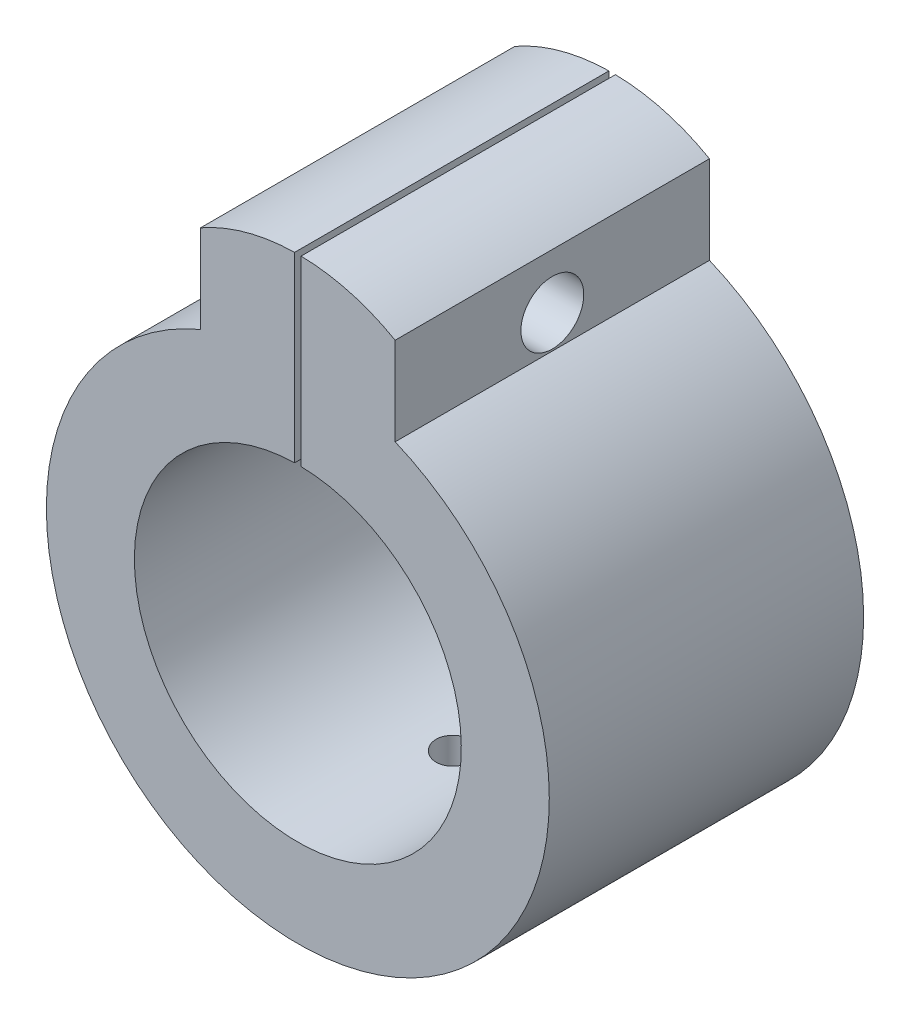
ISO-10303-21;
HEADER;
FILE_DESCRIPTION(('STEP AP214'),'2;1');
FILE_NAME('part.step','',(''),(''),'','','');
FILE_SCHEMA(('AUTOMOTIVE_DESIGN { 1 0 10303 214 1 1 1 1 }'));
ENDSEC;
DATA;
#1=APPLICATION_CONTEXT('core data for automotive mechanical design processes');
#2=APPLICATION_PROTOCOL_DEFINITION('international standard','automotive_design',2000,#1);
#3=PRODUCT_CONTEXT('',#1,'mechanical');
#4=PRODUCT('Part','Part','',(#3));
#5=PRODUCT_RELATED_PRODUCT_CATEGORY('part','',(#4));
#6=PRODUCT_DEFINITION_FORMATION('','',#4);
#7=PRODUCT_DEFINITION_CONTEXT('part definition',#1,'design');
#8=PRODUCT_DEFINITION('design','',#6,#7);
#9=PRODUCT_DEFINITION_SHAPE('','',#8);
#10=(LENGTH_UNIT() NAMED_UNIT(*) SI_UNIT(.MILLI.,.METRE.));
#11=(NAMED_UNIT(*) PLANE_ANGLE_UNIT() SI_UNIT($,.RADIAN.));
#12=(NAMED_UNIT(*) SI_UNIT($,.STERADIAN.) SOLID_ANGLE_UNIT());
#13=UNCERTAINTY_MEASURE_WITH_UNIT(LENGTH_MEASURE(1.E-05),#10,'distance_accuracy_value','');
#14=(GEOMETRIC_REPRESENTATION_CONTEXT(3) GLOBAL_UNCERTAINTY_ASSIGNED_CONTEXT((#13)) GLOBAL_UNIT_ASSIGNED_CONTEXT((#10,
#11,#12)) REPRESENTATION_CONTEXT('',''));
#15=CARTESIAN_POINT('',(0.,0.,0.));
#16=DIRECTION('',(0.,0.,1.));
#17=DIRECTION('',(1.,0.,0.));
#18=AXIS2_PLACEMENT_3D('',#15,#16,#17);
#19=CARTESIAN_POINT('',(0.,11.87489743787,10.));
#20=DIRECTION('',(0.,0.,-1.));
#21=DIRECTION('',(-1.,0.,0.));
#22=AXIS2_PLACEMENT_3D('',#19,#20,#21);
#23=CYLINDRICAL_SURFACE('',#22,15.6193467136848);
#24=DIRECTION('',(0.,0.,-1.));
#25=VECTOR('',#24,1.);
#26=CARTESIAN_POINT('',(-0.258597553957538,27.4921033040735,10.));
#27=LINE('',#26,#25);
#28=CARTESIAN_POINT('',(-0.258597553957538,27.4921033040735,0.));
#29=VERTEX_POINT('',#28);
#30=CARTESIAN_POINT('',(-0.258597553957538,27.4921033040735,25.));
#31=VERTEX_POINT('',#30);
#32=EDGE_CURVE('E163',#29,#31,#27,.F.);
#33=ORIENTED_EDGE('',*,*,#32,.F.);
#34=CARTESIAN_POINT('',(0.,11.87489743787,0.));
#35=DIRECTION('',(0.,0.,1.));
#36=DIRECTION('',(1.,0.,0.));
#37=AXIS2_PLACEMENT_3D('',#34,#35,#36);
#38=CIRCLE('',#37,15.6193467136848);
#39=CARTESIAN_POINT('',(-7.74027571439312,25.441478570472,0.));
#40=VERTEX_POINT('',#39);
#41=EDGE_CURVE('E139',#40,#29,#38,.F.);
#42=ORIENTED_EDGE('',*,*,#41,.F.);
#43=DIRECTION('',(0.,0.,-1.));
#44=VECTOR('',#43,1.);
#45=CARTESIAN_POINT('',(-7.74027571439312,25.441478570472,10.));
#46=LINE('',#45,#44);
#47=CARTESIAN_POINT('',(-7.74027571439312,25.441478570472,25.));
#48=VERTEX_POINT('',#47);
#49=EDGE_CURVE('E79',#48,#40,#46,.T.);
#50=ORIENTED_EDGE('',*,*,#49,.F.);
#51=CARTESIAN_POINT('',(0.,11.8748974378699,25.));
#52=DIRECTION('',(0.,0.,1.));
#53=DIRECTION('',(-1.,0.,0.));
#54=AXIS2_PLACEMENT_3D('',#51,#52,#53);
#55=CIRCLE('',#54,15.6193467136848);
#56=EDGE_CURVE('E156',#31,#48,#55,.T.);
#57=ORIENTED_EDGE('',*,*,#56,.F.);
#58=EDGE_LOOP('',(#33,#42,#50,#57));
#59=FACE_BOUND('',#58,.T.);
#60=ADVANCED_FACE('F36',(#59),#23,.T.);
#61=CARTESIAN_POINT('',(7.74027571439312,0.,10.));
#62=DIRECTION('',(-1.,0.,0.));
#63=DIRECTION('',(0.,0.,1.));
#64=AXIS2_PLACEMENT_3D('',#61,#62,#63);
#65=PLANE('',#64);
#66=CARTESIAN_POINT('',(7.74027571439312,21.0864235760214,12.5));
#67=DIRECTION('',(1.,0.,0.));
#68=DIRECTION('',(0.,0.,-1.));
#69=AXIS2_PLACEMENT_3D('',#66,#67,#68);
#70=CIRCLE('',#69,2.5);
#71=CARTESIAN_POINT('',(7.74027571439312,21.0864235760214,10.));
#72=VERTEX_POINT('',#71);
#73=EDGE_CURVE('E144',#72,#72,#70,.T.);
#74=ORIENTED_EDGE('',*,*,#73,.F.);
#75=EDGE_LOOP('',(#74));
#76=FACE_BOUND('',#75,.T.);
#77=DIRECTION('',(0.,1.,0.));
#78=VECTOR('',#77,1.);
#79=CARTESIAN_POINT('',(7.74027571439312,0.,0.));
#80=LINE('',#79,#78);
#81=CARTESIAN_POINT('',(7.74027571439312,18.441478570472,0.));
#82=VERTEX_POINT('',#81);
#83=CARTESIAN_POINT('',(7.74027571439312,25.441478570472,0.));
#84=VERTEX_POINT('',#83);
#85=EDGE_CURVE('E122',#82,#84,#80,.T.);
#86=ORIENTED_EDGE('',*,*,#85,.T.);
#87=DIRECTION('',(0.,0.,-1.));
#88=VECTOR('',#87,1.);
#89=CARTESIAN_POINT('',(7.74027571439312,25.441478570472,10.));
#90=LINE('',#89,#88);
#91=CARTESIAN_POINT('',(7.74027571439312,25.441478570472,25.));
#92=VERTEX_POINT('',#91);
#93=EDGE_CURVE('E134',#92,#84,#90,.T.);
#94=ORIENTED_EDGE('',*,*,#93,.F.);
#95=DIRECTION('',(0.,1.,0.));
#96=VECTOR('',#95,1.);
#97=CARTESIAN_POINT('',(7.74027571439312,18.441478570472,25.));
#98=LINE('',#97,#96);
#99=CARTESIAN_POINT('',(7.74027571439312,18.441478570472,25.));
#100=VERTEX_POINT('',#99);
#101=EDGE_CURVE('E132',#100,#92,#98,.T.);
#102=ORIENTED_EDGE('',*,*,#101,.F.);
#103=DIRECTION('',(0.,0.,-1.));
#104=VECTOR('',#103,1.);
#105=CARTESIAN_POINT('',(7.74027571439312,18.441478570472,10.));
#106=LINE('',#105,#104);
#107=EDGE_CURVE('E115',#100,#82,#106,.T.);
#108=ORIENTED_EDGE('',*,*,#107,.T.);
#109=EDGE_LOOP('',(#86,#94,#102,#108));
#110=FACE_BOUND('',#109,.T.);
#111=ADVANCED_FACE('F38',(#76,#110),#65,.F.);
#112=DIRECTION('',(0.,0.,-1.));
#113=VECTOR('',#112,1.);
#114=CARTESIAN_POINT('',(0.258597553957538,27.4921033040735,10.));
#115=LINE('',#114,#113);
#116=CARTESIAN_POINT('',(0.258597553957538,27.4921033040735,25.));
#117=VERTEX_POINT('',#116);
#118=CARTESIAN_POINT('',(0.258597553957538,27.4921033040735,0.));
#119=VERTEX_POINT('',#118);
#120=EDGE_CURVE('E170',#117,#119,#115,.T.);
#121=ORIENTED_EDGE('',*,*,#120,.F.);
#122=EDGE_CURVE('E153',#92,#117,#55,.T.);
#123=ORIENTED_EDGE('',*,*,#122,.F.);
#124=ORIENTED_EDGE('',*,*,#93,.T.);
#125=EDGE_CURVE('E126',#119,#84,#38,.F.);
#126=ORIENTED_EDGE('',*,*,#125,.F.);
#127=EDGE_LOOP('',(#121,#123,#124,#126));
#128=FACE_BOUND('',#127,.T.);
#129=ADVANCED_FACE('F226',(#128),#23,.T.);
#130=CARTESIAN_POINT('',(-7.74027571439312,0.,10.));
#131=DIRECTION('',(-1.,0.,0.));
#132=DIRECTION('',(0.,0.,1.));
#133=AXIS2_PLACEMENT_3D('',#130,#131,#132);
#134=PLANE('',#133);
#135=CARTESIAN_POINT('',(-7.74027571439312,21.0864235760214,12.5));
#136=DIRECTION('',(-1.,0.,0.));
#137=DIRECTION('',(0.,0.,1.));
#138=AXIS2_PLACEMENT_3D('',#135,#136,#137);
#139=CIRCLE('',#138,2.5);
#140=CARTESIAN_POINT('',(-7.74027571439312,21.0864235760214,15.));
#141=VERTEX_POINT('',#140);
#142=EDGE_CURVE('E175',#141,#141,#139,.T.);
#143=ORIENTED_EDGE('',*,*,#142,.F.);
#144=EDGE_LOOP('',(#143));
#145=FACE_BOUND('',#144,.T.);
#146=DIRECTION('',(0.,1.,0.));
#147=VECTOR('',#146,1.);
#148=CARTESIAN_POINT('',(-7.74027571439312,0.,0.));
#149=LINE('',#148,#147);
#150=CARTESIAN_POINT('',(-7.74027571439312,18.441478570472,0.));
#151=VERTEX_POINT('',#150);
#152=EDGE_CURVE('E119',#151,#40,#149,.T.);
#153=ORIENTED_EDGE('',*,*,#152,.F.);
#154=DIRECTION('',(0.,0.,-1.));
#155=VECTOR('',#154,1.);
#156=CARTESIAN_POINT('',(-7.74027571439312,18.441478570472,10.));
#157=LINE('',#156,#155);
#158=CARTESIAN_POINT('',(-7.74027571439312,18.441478570472,25.));
#159=VERTEX_POINT('',#158);
#160=EDGE_CURVE('E117',#159,#151,#157,.T.);
#161=ORIENTED_EDGE('',*,*,#160,.F.);
#162=DIRECTION('',(0.,-1.,0.));
#163=VECTOR('',#162,1.);
#164=CARTESIAN_POINT('',(-7.74027571439312,18.441478570472,25.));
#165=LINE('',#164,#163);
#166=EDGE_CURVE('E129',#48,#159,#165,.T.);
#167=ORIENTED_EDGE('',*,*,#166,.F.);
#168=ORIENTED_EDGE('',*,*,#49,.T.);
#169=EDGE_LOOP('',(#153,#161,#167,#168));
#170=FACE_BOUND('',#169,.T.);
#171=ADVANCED_FACE('F220',(#145,#170),#134,.T.);
#172=CARTESIAN_POINT('',(0.,0.,10.));
#173=DIRECTION('',(0.,0.,-1.));
#174=DIRECTION('',(-1.,0.,0.));
#175=AXIS2_PLACEMENT_3D('',#172,#173,#174);
#176=CYLINDRICAL_SURFACE('',#175,20.);
#177=CARTESIAN_POINT('',(0.,-20.,14.));
#178=CARTESIAN_POINT('',(0.0841288095114433,-19.9999992582729,13.999996313183));
#179=CARTESIAN_POINT('',(0.168315601024087,-19.9994635090758,13.9928985465594));
#180=CARTESIAN_POINT('',(0.334361941971538,-19.9973778078798,13.9646875154567));
#181=CARTESIAN_POINT('',(0.416218711162994,-19.9958266932389,13.943558183763));
#182=CARTESIAN_POINT('',(0.575175965959818,-19.9918856268593,13.8878966718803));
#183=CARTESIAN_POINT('',(0.652279036935091,-19.9894961359011,13.8533718528915));
#184=CARTESIAN_POINT('',(0.799576480678019,-19.9841466247064,13.7719120471363));
#185=CARTESIAN_POINT('',(0.869772371799849,-19.9811867302827,13.724979796204));
#186=CARTESIAN_POINT('',(1.00142895753254,-19.975021868989,13.6199307794625));
#187=CARTESIAN_POINT('',(1.06287322971852,-19.971816458291,13.5617934559158));
#188=CARTESIAN_POINT('',(1.17514165369782,-19.9655255838438,13.4360277026551));
#189=CARTESIAN_POINT('',(1.22596534904266,-19.9624401252546,13.3683988652259));
#190=CARTESIAN_POINT('',(1.31560383874766,-19.9567335395977,13.2254725451906));
#191=CARTESIAN_POINT('',(1.35440446810332,-19.954112961772,13.1501661549699));
#192=CARTESIAN_POINT('',(1.41880489046782,-19.9496376121017,12.9940846276562));
#193=CARTESIAN_POINT('',(1.44440487688688,-19.947782829037,12.9133095707074));
#194=CARTESIAN_POINT('',(1.48163037657928,-19.9450525889002,12.7487461075994));
#195=CARTESIAN_POINT('',(1.49328231044217,-19.9441752805014,12.6649637091924));
#196=CARTESIAN_POINT('',(1.50236254574838,-19.9434933892539,12.4966280467393));
#197=CARTESIAN_POINT('',(1.49979106810858,-19.943688789744,12.4120747946865));
#198=CARTESIAN_POINT('',(1.48051934417569,-19.9451285636931,12.2447781889461));
#199=CARTESIAN_POINT('',(1.46384775676394,-19.9463708093904,12.1620315130358));
#200=CARTESIAN_POINT('',(1.4168935522692,-19.9497609519804,12.0005143028844));
#201=CARTESIAN_POINT('',(1.38661082447336,-19.9519088562398,11.9217438009912));
#202=CARTESIAN_POINT('',(1.31326167189701,-19.9568707353614,11.7703232837612));
#203=CARTESIAN_POINT('',(1.27018232726496,-19.9596853828032,11.6976795498232));
#204=CARTESIAN_POINT('',(1.17247213743423,-19.9656629459514,11.5606433371351));
#205=CARTESIAN_POINT('',(1.11784110342877,-19.9688258673499,11.4962509932776));
#206=CARTESIAN_POINT('',(0.998417278432273,-19.9751530336147,11.3773787417564));
#207=CARTESIAN_POINT('',(0.933599700176313,-19.978317262423,11.3229237324053));
#208=CARTESIAN_POINT('',(0.795729375934442,-19.9842830152099,11.2256642364343));
#209=CARTESIAN_POINT('',(0.722676625718591,-19.9870845390023,11.1828597557987));
#210=CARTESIAN_POINT('',(0.570393940216334,-19.9920096041928,11.1101181697562));
#211=CARTESIAN_POINT('',(0.491163509428978,-19.9941330911371,11.0801820977587));
#212=CARTESIAN_POINT('',(0.328781652774543,-19.9974621500133,11.0340441877952));
#213=CARTESIAN_POINT('',(0.245630292842573,-19.998667737375,11.0178421189623));
#214=CARTESIAN_POINT('',(0.0779828437837506,-20.0000231735387,10.9996631904611));
#215=CARTESIAN_POINT('',(-0.00650949482532079,-20.0001755757578,10.9976519253458));
#216=CARTESIAN_POINT('',(-0.174630230993063,-19.9994142771364,11.0078216680697));
#217=CARTESIAN_POINT('',(-0.258258635054597,-19.9985005843263,11.0200025690053));
#218=CARTESIAN_POINT('',(-0.422180011176504,-19.9957115375324,11.0581823688106));
#219=CARTESIAN_POINT('',(-0.50247670164607,-19.9938372886011,11.0841653905587));
#220=CARTESIAN_POINT('',(-0.657570327384028,-19.9893378090841,11.1491956936367));
#221=CARTESIAN_POINT('',(-0.732367191799398,-19.9867125688255,11.1882431432368));
#222=CARTESIAN_POINT('',(-0.87449495937676,-19.9809993255836,11.2783808378979));
#223=CARTESIAN_POINT('',(-0.941811320255548,-19.9779104477497,11.3294939567188));
#224=CARTESIAN_POINT('',(-1.06692059601702,-19.9716201639251,11.4422789254691));
#225=CARTESIAN_POINT('',(-1.1247133767348,-19.9684187563499,11.5039509241233));
#226=CARTESIAN_POINT('',(-1.22925234979154,-19.9622567375937,11.6362519401321));
#227=CARTESIAN_POINT('',(-1.27597614708765,-19.9592966224009,11.706898679433));
#228=CARTESIAN_POINT('',(-1.35689744472608,-19.9539590285433,11.8550551983815));
#229=CARTESIAN_POINT('',(-1.39109504958689,-19.951581545017,11.9325649207578));
#230=CARTESIAN_POINT('',(-1.44595479238458,-19.9476809567371,12.0921668074873));
#231=CARTESIAN_POINT('',(-1.46663080672911,-19.9461569763152,12.1742541798527));
#232=CARTESIAN_POINT('',(-1.49390569339177,-19.9441328652441,12.3407472310157));
#233=CARTESIAN_POINT('',(-1.50050477907388,-19.9436327190765,12.4251528746556));
#234=CARTESIAN_POINT('',(-1.49943621553155,-19.9437130691626,12.5936639132474));
#235=CARTESIAN_POINT('',(-1.49180376085723,-19.9442908995857,12.6777695348961));
#236=CARTESIAN_POINT('',(-1.46256198193398,-19.9464564369575,12.84350108371));
#237=CARTESIAN_POINT('',(-1.44095263443385,-19.9480441455862,12.9251270067498));
#238=CARTESIAN_POINT('',(-1.38437900273526,-19.952049853556,13.0835856084218));
#239=CARTESIAN_POINT('',(-1.34941515840954,-19.9544678255495,13.1604184448325));
#240=CARTESIAN_POINT('',(-1.26712924619683,-19.9598616237908,13.3071289577146));
#241=CARTESIAN_POINT('',(-1.21980742681008,-19.9628374388209,13.3770067740018));
#242=CARTESIAN_POINT('',(-1.11401708946728,-19.9690203079162,13.508003349971));
#243=CARTESIAN_POINT('',(-1.05552268820001,-19.972227887963,13.5691011816401));
#244=CARTESIAN_POINT('',(-0.929090973452718,-19.9785081329158,13.6806340503108));
#245=CARTESIAN_POINT('',(-0.861151367795686,-19.9815807648333,13.7310664915061));
#246=CARTESIAN_POINT('',(-0.717650416603838,-19.9872494022766,13.8198911625391));
#247=CARTESIAN_POINT('',(-0.642077148267445,-19.9898446437752,13.858264160491));
#248=CARTESIAN_POINT('',(-0.48559391791521,-19.9942566719576,13.9217282844403));
#249=CARTESIAN_POINT('',(-0.404690263737666,-19.9960743603405,13.9468348030683));
#250=CARTESIAN_POINT('',(-0.26941791672437,-19.9982556200579,13.9766019885269));
#251=CARTESIAN_POINT('',(-0.215921192938044,-19.9989068154638,13.9853647187894));
#252=CARTESIAN_POINT('',(-0.10829098794799,-19.9997792437292,13.9970649051523));
#253=CARTESIAN_POINT('',(-0.0541575080690685,-20.0000004774832,14.0000023733704));
#254=CARTESIAN_POINT('',(0.,-20.,14.));
#255=B_SPLINE_CURVE_WITH_KNOTS('',3,(#177,#178,#179,#180,#181,#182,#183,#184,#185,#186,#187,
#188,#189,#190,#191,#192,#193,#194,#195,#196,#197,#198,#199,#200,#201,#202,#203,#204,#205,#206,
#207,#208,#209,#210,#211,#212,#213,#214,#215,#216,#217,#218,#219,#220,#221,#222,#223,#224,#225,
#226,#227,#228,#229,#230,#231,#232,#233,#234,#235,#236,#237,#238,#239,#240,#241,#242,#243,#244,
#245,#246,#247,#248,#249,#250,#251,#252,#253,#254),.UNSPECIFIED.,.T.,.F.,(4,2,2,2,2,2,2,2,2,2,2,
2,2,2,2,2,2,2,2,2,2,2,2,2,2,2,2,2,2,2,2,2,2,2,2,2,2,2,4),(0.,0.252188706341403,
0.504666687116075,0.757006120137033,1.00928995874569,1.2620411413344,1.51480318436672,
1.76786189721254,2.02091690224424,2.27349180470371,2.52606278420137,2.7781216361643,
3.0301825384079,3.28249879898397,3.53481918386621,3.78776333637314,4.04070761880367,
4.29367221036427,4.54663254953898,4.79897937776532,5.05132430518305,5.30337957695229,
5.55543809532427,5.8079783521194,6.06052216631005,6.31357265115638,6.56662102450254,
6.8194093000692,7.07219374409736,7.32435388202406,7.57651443943157,7.82866669184701,
8.08081387425119,8.33355244628146,8.58635246072108,8.83955360771711,9.09246032562223,
9.25480590484755,9.41715114636383),.UNSPECIFIED.);
#256=CARTESIAN_POINT('',(0.,-20.,14.));
#257=VERTEX_POINT('',#256);
#258=EDGE_CURVE('E182',#257,#257,#255,.T.);
#259=ORIENTED_EDGE('',*,*,#258,.T.);
#260=EDGE_LOOP('',(#259));
#261=FACE_BOUND('',#260,.T.);
#262=CARTESIAN_POINT('',(0.,0.,0.));
#263=DIRECTION('',(0.,0.,1.));
#264=DIRECTION('',(1.,0.,0.));
#265=AXIS2_PLACEMENT_3D('',#262,#263,#264);
#266=CIRCLE('',#265,20.);
#267=EDGE_CURVE('E71',#151,#82,#266,.T.);
#268=ORIENTED_EDGE('',*,*,#267,.T.);
#269=ORIENTED_EDGE('',*,*,#107,.F.);
#270=CARTESIAN_POINT('',(0.,0.,25.));
#271=DIRECTION('',(0.,0.,1.));
#272=DIRECTION('',(1.,0.,0.));
#273=AXIS2_PLACEMENT_3D('',#270,#271,#272);
#274=CIRCLE('',#273,20.);
#275=EDGE_CURVE('E158',#159,#100,#274,.T.);
#276=ORIENTED_EDGE('',*,*,#275,.F.);
#277=ORIENTED_EDGE('',*,*,#160,.T.);
#278=EDGE_LOOP('',(#268,#269,#276,#277));
#279=FACE_BOUND('',#278,.T.);
#280=ADVANCED_FACE('F112',(#261,#279),#176,.T.);
#281=CARTESIAN_POINT('',(0.,0.,10.));
#282=DIRECTION('',(0.,0.,-1.));
#283=DIRECTION('',(-1.,0.,0.));
#284=AXIS2_PLACEMENT_3D('',#281,#282,#283);
#285=CYLINDRICAL_SURFACE('',#284,13.);
#286=CARTESIAN_POINT('',(0.,-13.,14.));
#287=CARTESIAN_POINT('',(0.0839563147427423,-12.9999989044515,13.9999964031671));
#288=CARTESIAN_POINT('',(0.167966345196187,-12.999178081572,13.9929275849652));
#289=CARTESIAN_POINT('',(0.333652235419372,-12.995982599614,13.9648382649666));
#290=CARTESIAN_POINT('',(0.415325505475653,-12.9936062813601,13.9438028653164));
#291=CARTESIAN_POINT('',(0.57391497224922,-12.9875677351869,13.8884053338572));
#292=CARTESIAN_POINT('',(0.650834199520698,-12.9839063366207,13.8540517956907));
#293=CARTESIAN_POINT('',(0.79779979378714,-12.9757057473599,13.7730111181213));
#294=CARTESIAN_POINT('',(0.867847413269117,-12.9711667170809,13.7263262321012));
#295=CARTESIAN_POINT('',(0.999427807179225,-12.9616943551208,13.6217119644012));
#296=CARTESIAN_POINT('',(1.06092347729183,-12.9567594432832,13.5637360526228));
#297=CARTESIAN_POINT('',(1.17333502414497,-12.9470643855765,13.4382851632476));
#298=CARTESIAN_POINT('',(1.2242503828419,-12.9423042482743,13.3708097207967));
#299=CARTESIAN_POINT('',(1.3141916873334,-12.9334819604022,13.2280373361048));
#300=CARTESIAN_POINT('',(1.3531833171573,-12.9294218388056,13.1527186399223));
#301=CARTESIAN_POINT('',(1.41795120910938,-12.9224797052987,12.9965478380412));
#302=CARTESIAN_POINT('',(1.44372790011126,-12.9195976551562,12.915695912013));
#303=CARTESIAN_POINT('',(1.48122247723766,-12.9153528047108,12.7511364753763));
#304=CARTESIAN_POINT('',(1.49300261981048,-12.9139832786549,12.6674433262594));
#305=CARTESIAN_POINT('',(1.50236226854616,-12.9128978570991,12.4992575604559));
#306=CARTESIAN_POINT('',(1.49994226427626,-12.9131819045903,12.4147649714312));
#307=CARTESIAN_POINT('',(1.48102150197295,-12.9153653842397,12.2478106867289));
#308=CARTESIAN_POINT('',(1.46458907258954,-12.9172569773873,12.1653411304074));
#309=CARTESIAN_POINT('',(1.41821640637187,-12.9224301836669,12.0043381059818));
#310=CARTESIAN_POINT('',(1.38827593305336,-12.9257118211342,11.9258047068143));
#311=CARTESIAN_POINT('',(1.31566282618376,-12.9333043079058,11.7746895307639));
#312=CARTESIAN_POINT('',(1.27296024500285,-12.9376175732259,11.7021222704977));
#313=CARTESIAN_POINT('',(1.17605655290097,-12.9467853893456,11.5651582704928));
#314=CARTESIAN_POINT('',(1.12185499363063,-12.9516399612475,11.5007618494945));
#315=CARTESIAN_POINT('',(1.0031120359915,-12.9613782949516,11.3815707161917));
#316=CARTESIAN_POINT('',(0.93851169434214,-12.9662620604919,11.3268347087021));
#317=CARTESIAN_POINT('',(0.801008592236031,-12.9754816969276,11.2289743878324));
#318=CARTESIAN_POINT('',(0.7281058171361,-12.9798175668567,11.1858500949327));
#319=CARTESIAN_POINT('',(0.576023905679871,-12.9874550212078,11.1124382871552));
#320=CARTESIAN_POINT('',(0.496843118716626,-12.9907563324875,11.0821541615714));
#321=CARTESIAN_POINT('',(0.334473831095743,-12.9959501177405,11.0353274726576));
#322=CARTESIAN_POINT('',(0.251285490311375,-12.9978426478647,11.018784361637));
#323=CARTESIAN_POINT('',(0.0837704200050176,-12.999998373659,10.9999847236204));
#324=CARTESIAN_POINT('',(-0.000547113543200348,-13.0002707984128,10.9976472710681));
#325=CARTESIAN_POINT('',(-0.168372695685006,-12.9991804669134,11.007112154611));
#326=CARTESIAN_POINT('',(-0.251880758889223,-12.9978177402298,11.0189142350122));
#327=CARTESIAN_POINT('',(-0.415480266956156,-12.993616027243,11.056255972808));
#328=CARTESIAN_POINT('',(-0.49558056887289,-12.9907811576039,11.0817573287088));
#329=CARTESIAN_POINT('',(-0.650367161714354,-12.9839527929212,11.145734096229));
#330=CARTESIAN_POINT('',(-0.725053293857112,-12.9799592639147,11.1842098881644));
#331=CARTESIAN_POINT('',(-0.867254744569761,-12.9712363785455,11.2732411451229));
#332=CARTESIAN_POINT('',(-0.934736878832463,-12.9665038451426,11.3238492959128));
#333=CARTESIAN_POINT('',(-1.06027784673837,-12.9568430886348,11.4356337448152));
#334=CARTESIAN_POINT('',(-1.11833636324618,-12.9519148589511,11.4968103984491));
#335=CARTESIAN_POINT('',(-1.22366664140002,-12.9423899602444,11.6283503853359));
#336=CARTESIAN_POINT('',(-1.27088497439797,-12.9377950067668,11.6987566435089));
#337=CARTESIAN_POINT('',(-1.35282617315314,-12.9294843210235,11.846547575845));
#338=CARTESIAN_POINT('',(-1.38754925754463,-12.9257685733744,11.9239321278765));
#339=CARTESIAN_POINT('',(-1.44342658284102,-12.9196483466479,12.0833061537355));
#340=CARTESIAN_POINT('',(-1.46461162925533,-12.91724089246,12.1652847079304));
#341=CARTESIAN_POINT('',(-1.49291104062265,-12.9140010380224,12.3316649395144));
#342=CARTESIAN_POINT('',(-1.50002595610949,-12.9131685761468,12.4160665219645));
#343=CARTESIAN_POINT('',(-1.49997405326828,-12.9131745631781,12.5843656537594));
#344=CARTESIAN_POINT('',(-1.49289116482699,-12.9140031925958,12.668263241811));
#345=CARTESIAN_POINT('',(-1.46482172327171,-12.9172169582806,12.8336675019932));
#346=CARTESIAN_POINT('',(-1.44383516225563,-12.9196020954323,12.915174172765));
#347=CARTESIAN_POINT('',(-1.38857911797313,-12.9256572251488,13.0734760916893));
#348=CARTESIAN_POINT('',(-1.35431304208042,-12.9293268880955,13.1502725425812));
#349=CARTESIAN_POINT('',(-1.27347900341466,-12.9375381901497,13.2970384003879));
#350=CARTESIAN_POINT('',(-1.22691097725304,-12.9420798337501,13.3670077721221));
#351=CARTESIAN_POINT('',(-1.12248173071088,-12.9515555600008,13.4985629533293));
#352=CARTESIAN_POINT('',(-1.06455790771248,-12.9564917239034,13.560098921175));
#353=CARTESIAN_POINT('',(-0.939190054186289,-12.9661816355574,13.6726111148908));
#354=CARTESIAN_POINT('',(-0.871743768617548,-12.9709353397599,13.7235848324088));
#355=CARTESIAN_POINT('',(-0.728996893197092,-12.9797415177439,13.8136635640703));
#356=CARTESIAN_POINT('',(-0.653671391511422,-12.9837916526637,13.8527293056854));
#357=CARTESIAN_POINT('',(-0.497527270565883,-12.9907101076694,13.9176031050395));
#358=CARTESIAN_POINT('',(-0.416714824913399,-12.993579731148,13.9434257921356));
#359=CARTESIAN_POINT('',(-0.279556305332049,-12.9971099824635,13.9747928548381));
#360=CARTESIAN_POINT('',(-0.224080319679961,-12.9981885527758,13.9842322271337));
#361=CARTESIAN_POINT('',(-0.112410914672187,-12.9996339262189,13.9968369852807));
#362=CARTESIAN_POINT('',(-0.0562174995863219,-13.0000007335839,14.0000024084544));
#363=CARTESIAN_POINT('',(0.,-13.,14.));
#364=B_SPLINE_CURVE_WITH_KNOTS('',3,(#286,#287,#288,#289,#290,#291,#292,#293,#294,#295,#296,
#297,#298,#299,#300,#301,#302,#303,#304,#305,#306,#307,#308,#309,#310,#311,#312,#313,#314,#315,
#316,#317,#318,#319,#320,#321,#322,#323,#324,#325,#326,#327,#328,#329,#330,#331,#332,#333,#334,
#335,#336,#337,#338,#339,#340,#341,#342,#343,#344,#345,#346,#347,#348,#349,#350,#351,#352,#353,
#354,#355,#356,#357,#358,#359,#360,#361,#362,#363),.UNSPECIFIED.,.T.,.F.,(4,2,2,2,2,2,2,2,2,2,2,
2,2,2,2,2,2,2,2,2,2,2,2,2,2,2,2,2,2,2,2,2,2,2,2,2,2,2,4),(0.,0.251663624421979,
0.503596125244171,0.755366334321088,1.00709056767771,1.25987498270023,1.51267177188699,
1.76618939688668,2.0196987937799,2.27207631201581,2.52444512928255,2.77559031440111,
3.02673989646913,3.27848351780672,3.53023695652505,3.7834711988091,4.0367058877347,
4.29000737900444,4.54329877367693,4.79514587715501,5.04698842639316,5.29813049175019,
5.54927991940194,5.80154039645153,6.05380936112788,6.30729621090899,6.56077862511548,
6.81368217226278,7.0665758236448,7.31797891068329,7.56938214060554,7.82072090595902,
8.07206096641734,8.32482769676521,8.57765438622356,8.83130609524226,9.08467699305617,
9.25319301127889,9.42170802703663),.UNSPECIFIED.);
#365=CARTESIAN_POINT('',(0.,-13.,14.));
#366=VERTEX_POINT('',#365);
#367=EDGE_CURVE('E40',#366,#366,#364,.T.);
#368=ORIENTED_EDGE('',*,*,#367,.F.);
#369=EDGE_LOOP('',(#368));
#370=FACE_BOUND('',#369,.T.);
#371=DIRECTION('',(0.,0.,-1.));
#372=VECTOR('',#371,1.);
#373=CARTESIAN_POINT('',(-0.258597553957538,12.9974277187868,10.));
#374=LINE('',#373,#372);
#375=CARTESIAN_POINT('',(-0.258597553957538,12.9974277187868,25.));
#376=VERTEX_POINT('',#375);
#377=CARTESIAN_POINT('',(-0.258597553957538,12.9974277187868,0.));
#378=VERTEX_POINT('',#377);
#379=EDGE_CURVE('E165',#376,#378,#374,.T.);
#380=ORIENTED_EDGE('',*,*,#379,.F.);
#381=CARTESIAN_POINT('',(0.,0.,25.));
#382=DIRECTION('',(0.,0.,1.));
#383=DIRECTION('',(1.,0.,0.));
#384=AXIS2_PLACEMENT_3D('',#381,#382,#383);
#385=CIRCLE('',#384,13.);
#386=CARTESIAN_POINT('',(0.258597553957538,12.9974277187868,25.));
#387=VERTEX_POINT('',#386);
#388=EDGE_CURVE('E160',#376,#387,#385,.T.);
#389=ORIENTED_EDGE('',*,*,#388,.T.);
#390=DIRECTION('',(0.,0.,-1.));
#391=VECTOR('',#390,1.);
#392=CARTESIAN_POINT('',(0.258597553957538,12.9974277187868,10.));
#393=LINE('',#392,#391);
#394=CARTESIAN_POINT('',(0.258597553957538,12.9974277187868,0.));
#395=VERTEX_POINT('',#394);
#396=EDGE_CURVE('E59',#395,#387,#393,.F.);
#397=ORIENTED_EDGE('',*,*,#396,.F.);
#398=CARTESIAN_POINT('',(0.,0.,0.));
#399=DIRECTION('',(0.,0.,1.));
#400=DIRECTION('',(1.,0.,0.));
#401=AXIS2_PLACEMENT_3D('',#398,#399,#400);
#402=CIRCLE('',#401,13.);
#403=EDGE_CURVE('E118',#378,#395,#402,.T.);
#404=ORIENTED_EDGE('',*,*,#403,.F.);
#405=EDGE_LOOP('',(#380,#389,#397,#404));
#406=FACE_BOUND('',#405,.T.);
#407=ADVANCED_FACE('F213',(#370,#406),#285,.F.);
#408=CARTESIAN_POINT('',(0.,0.,0.));
#409=DIRECTION('',(0.,0.,1.));
#410=DIRECTION('',(1.,0.,0.));
#411=AXIS2_PLACEMENT_3D('',#408,#409,#410);
#412=PLANE('',#411);
#413=ORIENTED_EDGE('',*,*,#85,.F.);
#414=ORIENTED_EDGE('',*,*,#267,.F.);
#415=ORIENTED_EDGE('',*,*,#152,.T.);
#416=ORIENTED_EDGE('',*,*,#41,.T.);
#417=DIRECTION('',(0.,-1.,0.));
#418=VECTOR('',#417,1.);
#419=CARTESIAN_POINT('',(-0.258597553957538,0.,0.));
#420=LINE('',#419,#418);
#421=EDGE_CURVE('E167',#29,#378,#420,.T.);
#422=ORIENTED_EDGE('',*,*,#421,.T.);
#423=ORIENTED_EDGE('',*,*,#403,.T.);
#424=DIRECTION('',(0.,1.,0.));
#425=VECTOR('',#424,1.);
#426=CARTESIAN_POINT('',(0.258597553957538,0.,0.));
#427=LINE('',#426,#425);
#428=EDGE_CURVE('E173',#395,#119,#427,.T.);
#429=ORIENTED_EDGE('',*,*,#428,.T.);
#430=ORIENTED_EDGE('',*,*,#125,.T.);
#431=EDGE_LOOP('',(#413,#414,#415,#416,#422,#423,#429,#430));
#432=FACE_BOUND('',#431,.T.);
#433=ADVANCED_FACE('F123',(#432),#412,.F.);
#434=CARTESIAN_POINT('',(0.,0.,25.));
#435=DIRECTION('',(0.,0.,1.));
#436=DIRECTION('',(1.,0.,0.));
#437=AXIS2_PLACEMENT_3D('',#434,#435,#436);
#438=PLANE('',#437);
#439=DIRECTION('',(0.,-1.,0.));
#440=VECTOR('',#439,1.);
#441=CARTESIAN_POINT('',(-0.258597553957538,0.,25.));
#442=LINE('',#441,#440);
#443=EDGE_CURVE('E11',#31,#376,#442,.T.);
#444=ORIENTED_EDGE('',*,*,#443,.F.);
#445=ORIENTED_EDGE('',*,*,#56,.T.);
#446=ORIENTED_EDGE('',*,*,#166,.T.);
#447=ORIENTED_EDGE('',*,*,#275,.T.);
#448=ORIENTED_EDGE('',*,*,#101,.T.);
#449=ORIENTED_EDGE('',*,*,#122,.T.);
#450=DIRECTION('',(0.,1.,0.));
#451=VECTOR('',#450,1.);
#452=CARTESIAN_POINT('',(0.258597553957538,0.,25.));
#453=LINE('',#452,#451);
#454=EDGE_CURVE('E50',#387,#117,#453,.T.);
#455=ORIENTED_EDGE('',*,*,#454,.F.);
#456=ORIENTED_EDGE('',*,*,#388,.F.);
#457=EDGE_LOOP('',(#444,#445,#446,#447,#448,#449,#455,#456));
#458=FACE_BOUND('',#457,.T.);
#459=ADVANCED_FACE('F207',(#458),#438,.T.);
#460=CARTESIAN_POINT('',(0.258597553957538,12.3781063786396,-2.50000000007189E-05));
#461=DIRECTION('',(1.,0.,0.));
#462=DIRECTION('',(0.,0.,-1.));
#463=AXIS2_PLACEMENT_3D('',#460,#461,#462);
#464=PLANE('',#463);
#465=CARTESIAN_POINT('',(0.258597553957539,21.0864235760214,12.5));
#466=DIRECTION('',(1.,0.,0.));
#467=DIRECTION('',(0.,0.,-1.));
#468=AXIS2_PLACEMENT_3D('',#465,#466,#467);
#469=CIRCLE('',#468,2.5);
#470=CARTESIAN_POINT('',(0.258597553957539,21.0864235760214,10.));
#471=VERTEX_POINT('',#470);
#472=EDGE_CURVE('E143',#471,#471,#469,.T.);
#473=ORIENTED_EDGE('',*,*,#472,.T.);
#474=EDGE_LOOP('',(#473));
#475=FACE_BOUND('',#474,.T.);
#476=ORIENTED_EDGE('',*,*,#120,.T.);
#477=ORIENTED_EDGE('',*,*,#428,.F.);
#478=ORIENTED_EDGE('',*,*,#396,.T.);
#479=ORIENTED_EDGE('',*,*,#454,.T.);
#480=EDGE_LOOP('',(#476,#477,#478,#479));
#481=FACE_BOUND('',#480,.T.);
#482=ADVANCED_FACE('F203',(#475,#481),#464,.F.);
#483=CARTESIAN_POINT('',(-0.258597553957538,12.3781063786396,-2.50000000007189E-05));
#484=DIRECTION('',(-1.,0.,0.));
#485=DIRECTION('',(0.,0.,1.));
#486=AXIS2_PLACEMENT_3D('',#483,#484,#485);
#487=PLANE('',#486);
#488=CARTESIAN_POINT('',(-0.258597553957539,21.0864235760214,12.5));
#489=DIRECTION('',(-1.,0.,0.));
#490=DIRECTION('',(0.,0.,1.));
#491=AXIS2_PLACEMENT_3D('',#488,#489,#490);
#492=CIRCLE('',#491,2.5);
#493=CARTESIAN_POINT('',(-0.258597553957539,21.0864235760214,15.));
#494=VERTEX_POINT('',#493);
#495=EDGE_CURVE('E141',#494,#494,#492,.T.);
#496=ORIENTED_EDGE('',*,*,#495,.T.);
#497=EDGE_LOOP('',(#496));
#498=FACE_BOUND('',#497,.T.);
#499=ORIENTED_EDGE('',*,*,#32,.T.);
#500=ORIENTED_EDGE('',*,*,#443,.T.);
#501=ORIENTED_EDGE('',*,*,#379,.T.);
#502=ORIENTED_EDGE('',*,*,#421,.F.);
#503=EDGE_LOOP('',(#499,#500,#501,#502));
#504=FACE_BOUND('',#503,.T.);
#505=ADVANCED_FACE('F200',(#498,#504),#487,.F.);
#506=CARTESIAN_POINT('',(-35.0000250000568,21.0864235760214,12.5));
#507=DIRECTION('',(1.,0.,0.));
#508=DIRECTION('',(0.,0.,-1.));
#509=AXIS2_PLACEMENT_3D('',#506,#507,#508);
#510=CYLINDRICAL_SURFACE('',#509,2.5);
#511=ORIENTED_EDGE('',*,*,#142,.T.);
#512=EDGE_LOOP('',(#511));
#513=FACE_BOUND('',#512,.T.);
#514=ORIENTED_EDGE('',*,*,#495,.F.);
#515=EDGE_LOOP('',(#514));
#516=FACE_BOUND('',#515,.T.);
#517=ADVANCED_FACE('F198',(#513,#516),#510,.F.);
#518=ORIENTED_EDGE('',*,*,#73,.T.);
#519=EDGE_LOOP('',(#518));
#520=FACE_BOUND('',#519,.T.);
#521=ORIENTED_EDGE('',*,*,#472,.F.);
#522=EDGE_LOOP('',(#521));
#523=FACE_BOUND('',#522,.T.);
#524=ADVANCED_FACE('F193',(#520,#523),#510,.F.);
#525=CARTESIAN_POINT('',(0.,-20.,12.5));
#526=DIRECTION('',(0.,1.,0.));
#527=DIRECTION('',(0.,0.,1.));
#528=AXIS2_PLACEMENT_3D('',#525,#526,#527);
#529=CYLINDRICAL_SURFACE('',#528,1.5);
#530=ORIENTED_EDGE('',*,*,#367,.T.);
#531=EDGE_LOOP('',(#530));
#532=FACE_BOUND('',#531,.T.);
#533=ORIENTED_EDGE('',*,*,#258,.F.);
#534=EDGE_LOOP('',(#533));
#535=FACE_BOUND('',#534,.T.);
#536=ADVANCED_FACE('F189',(#532,#535),#529,.F.);
#537=CLOSED_SHELL('',(#60,#111,#129,#171,#280,#407,#433,#459,#482,#505,#517,#524,#536));
#538=MANIFOLD_SOLID_BREP('B2',#537);
#539=ADVANCED_BREP_SHAPE_REPRESENTATION('',(#18,#538),#14);
#540=SHAPE_DEFINITION_REPRESENTATION(#9,#539);
ENDSEC;
END-ISO-10303-21;
